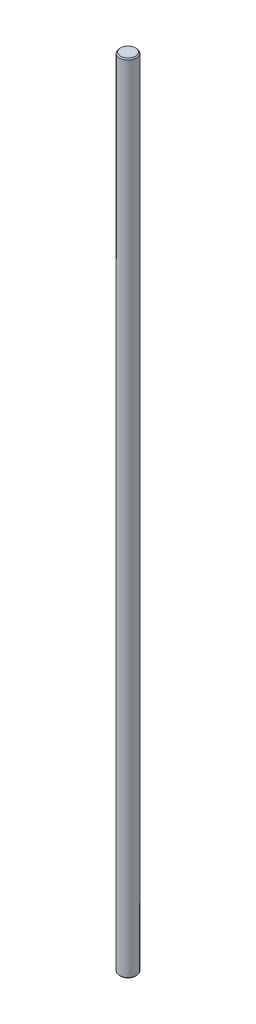
ISO-10303-21;
HEADER;
FILE_DESCRIPTION(('STEP AP214'),'2;1');
FILE_NAME('part.step','',(''),(''),'','','');
FILE_SCHEMA(('AUTOMOTIVE_DESIGN { 1 0 10303 214 1 1 1 1 }'));
ENDSEC;
DATA;
#1=APPLICATION_CONTEXT('core data for automotive mechanical design processes');
#2=APPLICATION_PROTOCOL_DEFINITION('international standard','automotive_design',2000,#1);
#3=PRODUCT_CONTEXT('',#1,'mechanical');
#4=PRODUCT('Part','Part','',(#3));
#5=PRODUCT_RELATED_PRODUCT_CATEGORY('part','',(#4));
#6=PRODUCT_DEFINITION_FORMATION('','',#4);
#7=PRODUCT_DEFINITION_CONTEXT('part definition',#1,'design');
#8=PRODUCT_DEFINITION('design','',#6,#7);
#9=PRODUCT_DEFINITION_SHAPE('','',#8);
#10=(LENGTH_UNIT() NAMED_UNIT(*) SI_UNIT(.MILLI.,.METRE.));
#11=(NAMED_UNIT(*) PLANE_ANGLE_UNIT() SI_UNIT($,.RADIAN.));
#12=(NAMED_UNIT(*) SI_UNIT($,.STERADIAN.) SOLID_ANGLE_UNIT());
#13=UNCERTAINTY_MEASURE_WITH_UNIT(LENGTH_MEASURE(1.E-05),#10,'distance_accuracy_value','');
#14=(GEOMETRIC_REPRESENTATION_CONTEXT(3) GLOBAL_UNCERTAINTY_ASSIGNED_CONTEXT((#13)) GLOBAL_UNIT_ASSIGNED_CONTEXT((#10,
#11,#12)) REPRESENTATION_CONTEXT('',''));
#15=CARTESIAN_POINT('',(0.,0.,0.));
#16=DIRECTION('',(0.,0.,1.));
#17=DIRECTION('',(1.,0.,0.));
#18=AXIS2_PLACEMENT_3D('',#15,#16,#17);
#19=CARTESIAN_POINT('',(0.,-190.,0.));
#20=DIRECTION('',(0.,1.,0.));
#21=DIRECTION('',(0.,0.,1.));
#22=AXIS2_PLACEMENT_3D('',#19,#20,#21);
#23=CYLINDRICAL_SURFACE('',#22,4.);
#24=CARTESIAN_POINT('',(0.,-189.5,0.));
#25=DIRECTION('',(0.,1.,0.));
#26=DIRECTION('',(0.,0.,1.));
#27=AXIS2_PLACEMENT_3D('',#24,#25,#26);
#28=CIRCLE('',#27,4.);
#29=CARTESIAN_POINT('',(0.,-189.5,4.));
#30=VERTEX_POINT('',#29);
#31=EDGE_CURVE('E44',#30,#30,#28,.T.);
#32=ORIENTED_EDGE('',*,*,#31,.T.);
#33=EDGE_LOOP('',(#32));
#34=FACE_BOUND('',#33,.T.);
#35=CARTESIAN_POINT('',(0.,189.5,0.));
#36=DIRECTION('',(0.,1.,0.));
#37=DIRECTION('',(0.,0.,1.));
#38=AXIS2_PLACEMENT_3D('',#35,#36,#37);
#39=CIRCLE('',#38,4.);
#40=CARTESIAN_POINT('',(0.,189.5,4.));
#41=VERTEX_POINT('',#40);
#42=EDGE_CURVE('E48',#41,#41,#39,.F.);
#43=ORIENTED_EDGE('',*,*,#42,.T.);
#44=EDGE_LOOP('',(#43));
#45=FACE_BOUND('',#44,.T.);
#46=ADVANCED_FACE('F32',(#34,#45),#23,.T.);
#47=CARTESIAN_POINT('',(0.,-190.,0.));
#48=DIRECTION('',(0.,1.,0.));
#49=DIRECTION('',(0.,0.,1.));
#50=AXIS2_PLACEMENT_3D('',#47,#48,#49);
#51=PLANE('',#50);
#52=CARTESIAN_POINT('',(0.,-190.,0.));
#53=DIRECTION('',(0.,1.,0.));
#54=DIRECTION('',(0.,0.,1.));
#55=AXIS2_PLACEMENT_3D('',#52,#53,#54);
#56=CIRCLE('',#55,3.5);
#57=CARTESIAN_POINT('',(0.,-190.,3.5));
#58=VERTEX_POINT('',#57);
#59=EDGE_CURVE('E40',#58,#58,#56,.F.);
#60=ORIENTED_EDGE('',*,*,#59,.T.);
#61=EDGE_LOOP('',(#60));
#62=FACE_BOUND('',#61,.T.);
#63=ADVANCED_FACE('F64',(#62),#51,.F.);
#64=CARTESIAN_POINT('',(0.,190.,0.));
#65=DIRECTION('',(0.,1.,0.));
#66=DIRECTION('',(0.,0.,1.));
#67=AXIS2_PLACEMENT_3D('',#64,#65,#66);
#68=PLANE('',#67);
#69=CARTESIAN_POINT('',(0.,190.,0.));
#70=DIRECTION('',(0.,1.,0.));
#71=DIRECTION('',(0.,0.,1.));
#72=AXIS2_PLACEMENT_3D('',#69,#70,#71);
#73=CIRCLE('',#72,3.5);
#74=CARTESIAN_POINT('',(0.,190.,3.5));
#75=VERTEX_POINT('',#74);
#76=EDGE_CURVE('E10',#75,#75,#73,.T.);
#77=ORIENTED_EDGE('',*,*,#76,.T.);
#78=EDGE_LOOP('',(#77));
#79=FACE_BOUND('',#78,.T.);
#80=ADVANCED_FACE('F61',(#79),#68,.T.);
#81=CARTESIAN_POINT('',(0.,-189.5,0.));
#82=DIRECTION('',(0.,1.,0.));
#83=DIRECTION('',(0.,0.,1.));
#84=AXIS2_PLACEMENT_3D('',#81,#82,#83);
#85=CONICAL_SURFACE('',#84,4.,0.7853981633975);
#86=ORIENTED_EDGE('',*,*,#59,.F.);
#87=EDGE_LOOP('',(#86));
#88=FACE_BOUND('',#87,.T.);
#89=ORIENTED_EDGE('',*,*,#31,.F.);
#90=EDGE_LOOP('',(#89));
#91=FACE_BOUND('',#90,.T.);
#92=ADVANCED_FACE('F57',(#88,#91),#85,.T.);
#93=CARTESIAN_POINT('',(0.,190.,0.));
#94=DIRECTION('',(0.,-1.,0.));
#95=DIRECTION('',(0.,0.,-1.));
#96=AXIS2_PLACEMENT_3D('',#93,#94,#95);
#97=CONICAL_SURFACE('',#96,3.5,0.785398163397445);
#98=ORIENTED_EDGE('',*,*,#42,.F.);
#99=EDGE_LOOP('',(#98));
#100=FACE_BOUND('',#99,.T.);
#101=ORIENTED_EDGE('',*,*,#76,.F.);
#102=EDGE_LOOP('',(#101));
#103=FACE_BOUND('',#102,.T.);
#104=ADVANCED_FACE('F35',(#100,#103),#97,.T.);
#105=CLOSED_SHELL('',(#46,#63,#80,#92,#104));
#106=MANIFOLD_SOLID_BREP('B2',#105);
#107=ADVANCED_BREP_SHAPE_REPRESENTATION('',(#18,#106),#14);
#108=SHAPE_DEFINITION_REPRESENTATION(#9,#107);
ENDSEC;
END-ISO-10303-21;
